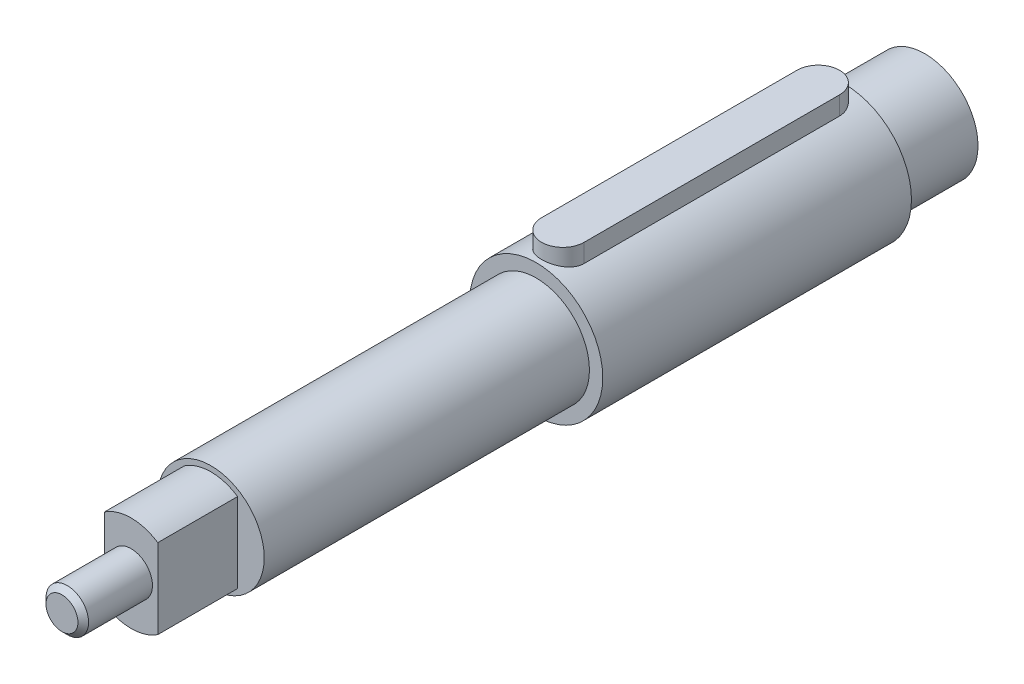
ISO-10303-21;
HEADER;
FILE_DESCRIPTION(('STEP AP214'),'2;1');
FILE_NAME('part.step','',(''),(''),'','','');
FILE_SCHEMA(('AUTOMOTIVE_DESIGN { 1 0 10303 214 1 1 1 1 }'));
ENDSEC;
DATA;
#1=APPLICATION_CONTEXT('core data for automotive mechanical design processes');
#2=APPLICATION_PROTOCOL_DEFINITION('international standard','automotive_design',2000,#1);
#3=PRODUCT_CONTEXT('',#1,'mechanical');
#4=PRODUCT('Part','Part','',(#3));
#5=PRODUCT_RELATED_PRODUCT_CATEGORY('part','',(#4));
#6=PRODUCT_DEFINITION_FORMATION('','',#4);
#7=PRODUCT_DEFINITION_CONTEXT('part definition',#1,'design');
#8=PRODUCT_DEFINITION('design','',#6,#7);
#9=PRODUCT_DEFINITION_SHAPE('','',#8);
#10=(LENGTH_UNIT() NAMED_UNIT(*) SI_UNIT(.MILLI.,.METRE.));
#11=(NAMED_UNIT(*) PLANE_ANGLE_UNIT() SI_UNIT($,.RADIAN.));
#12=(NAMED_UNIT(*) SI_UNIT($,.STERADIAN.) SOLID_ANGLE_UNIT());
#13=UNCERTAINTY_MEASURE_WITH_UNIT(LENGTH_MEASURE(1.E-05),#10,'distance_accuracy_value','');
#14=(GEOMETRIC_REPRESENTATION_CONTEXT(3) GLOBAL_UNCERTAINTY_ASSIGNED_CONTEXT((#13)) GLOBAL_UNIT_ASSIGNED_CONTEXT((#10,
#11,#12)) REPRESENTATION_CONTEXT('',''));
#15=CARTESIAN_POINT('',(0.,0.,0.));
#16=DIRECTION('',(0.,0.,1.));
#17=DIRECTION('',(1.,0.,0.));
#18=AXIS2_PLACEMENT_3D('',#15,#16,#17);
#19=CARTESIAN_POINT('',(0.,15.3,5.));
#20=DIRECTION('',(0.,-1.,0.));
#21=DIRECTION('',(0.,0.,-1.));
#22=AXIS2_PLACEMENT_3D('',#19,#20,#21);
#23=CYLINDRICAL_SURFACE('',#22,4.);
#24=CARTESIAN_POINT('',(0.,9.3,5.));
#25=DIRECTION('',(0.,1.,0.));
#26=DIRECTION('',(0.,0.,1.));
#27=AXIS2_PLACEMENT_3D('',#24,#25,#26);
#28=CIRCLE('',#27,4.);
#29=CARTESIAN_POINT('',(4.,9.3,5.));
#30=VERTEX_POINT('',#29);
#31=CARTESIAN_POINT('',(-4.,9.3,5.));
#32=VERTEX_POINT('',#31);
#33=EDGE_CURVE('E105',#30,#32,#28,.T.);
#34=ORIENTED_EDGE('',*,*,#33,.T.);
#35=DIRECTION('',(0.,-1.,0.));
#36=VECTOR('',#35,1.);
#37=CARTESIAN_POINT('',(-4.,15.3,5.));
#38=LINE('',#37,#36);
#39=CARTESIAN_POINT('',(-4.,15.3,5.));
#40=VERTEX_POINT('',#39);
#41=EDGE_CURVE('E12',#40,#32,#38,.T.);
#42=ORIENTED_EDGE('',*,*,#41,.F.);
#43=CARTESIAN_POINT('',(0.,15.3,5.));
#44=DIRECTION('',(0.,1.,0.));
#45=DIRECTION('',(0.,0.,1.));
#46=AXIS2_PLACEMENT_3D('',#43,#44,#45);
#47=CIRCLE('',#46,4.);
#48=CARTESIAN_POINT('',(4.,15.3,5.));
#49=VERTEX_POINT('',#48);
#50=EDGE_CURVE('E93',#49,#40,#47,.T.);
#51=ORIENTED_EDGE('',*,*,#50,.F.);
#52=DIRECTION('',(0.,-1.,0.));
#53=VECTOR('',#52,1.);
#54=CARTESIAN_POINT('',(4.,15.3,5.));
#55=LINE('',#54,#53);
#56=EDGE_CURVE('E101',#49,#30,#55,.T.);
#57=ORIENTED_EDGE('',*,*,#56,.T.);
#58=EDGE_LOOP('',(#34,#42,#51,#57));
#59=FACE_BOUND('',#58,.T.);
#60=ADVANCED_FACE('F42',(#59),#23,.T.);
#61=CARTESIAN_POINT('',(-4.,15.3,5.));
#62=DIRECTION('',(1.,0.,0.));
#63=DIRECTION('',(0.,0.,-1.));
#64=AXIS2_PLACEMENT_3D('',#61,#62,#63);
#65=PLANE('',#64);
#66=DIRECTION('',(0.,0.,1.));
#67=VECTOR('',#66,1.);
#68=CARTESIAN_POINT('',(-4.,9.3,5.));
#69=LINE('',#68,#67);
#70=CARTESIAN_POINT('',(-3.99999999999999,9.3,53.));
#71=VERTEX_POINT('',#70);
#72=EDGE_CURVE('E97',#32,#71,#69,.T.);
#73=ORIENTED_EDGE('',*,*,#72,.T.);
#74=DIRECTION('',(0.,-1.,0.));
#75=VECTOR('',#74,1.);
#76=CARTESIAN_POINT('',(-3.99999999999999,15.3,53.));
#77=LINE('',#76,#75);
#78=CARTESIAN_POINT('',(-3.99999999999999,15.3,53.));
#79=VERTEX_POINT('',#78);
#80=EDGE_CURVE('E50',#79,#71,#77,.T.);
#81=ORIENTED_EDGE('',*,*,#80,.F.);
#82=DIRECTION('',(0.,0.,1.));
#83=VECTOR('',#82,1.);
#84=CARTESIAN_POINT('',(-4.,15.3,5.));
#85=LINE('',#84,#83);
#86=EDGE_CURVE('E88',#40,#79,#85,.T.);
#87=ORIENTED_EDGE('',*,*,#86,.F.);
#88=ORIENTED_EDGE('',*,*,#41,.T.);
#89=EDGE_LOOP('',(#73,#81,#87,#88));
#90=FACE_BOUND('',#89,.T.);
#91=ADVANCED_FACE('F96',(#90),#65,.F.);
#92=CARTESIAN_POINT('',(0.,15.3,53.));
#93=DIRECTION('',(0.,-1.,0.));
#94=DIRECTION('',(0.,0.,-1.));
#95=AXIS2_PLACEMENT_3D('',#92,#93,#94);
#96=CYLINDRICAL_SURFACE('',#95,4.);
#97=CARTESIAN_POINT('',(0.,9.3,53.));
#98=DIRECTION('',(0.,1.,0.));
#99=DIRECTION('',(0.,0.,1.));
#100=AXIS2_PLACEMENT_3D('',#97,#98,#99);
#101=CIRCLE('',#100,4.);
#102=CARTESIAN_POINT('',(4.00000000000001,9.3,53.));
#103=VERTEX_POINT('',#102);
#104=EDGE_CURVE('E75',#71,#103,#101,.T.);
#105=ORIENTED_EDGE('',*,*,#104,.T.);
#106=DIRECTION('',(0.,-1.,0.));
#107=VECTOR('',#106,1.);
#108=CARTESIAN_POINT('',(4.00000000000001,15.3,53.));
#109=LINE('',#108,#107);
#110=CARTESIAN_POINT('',(4.00000000000001,15.3,53.));
#111=VERTEX_POINT('',#110);
#112=EDGE_CURVE('E98',#111,#103,#109,.T.);
#113=ORIENTED_EDGE('',*,*,#112,.F.);
#114=CARTESIAN_POINT('',(0.,15.3,53.));
#115=DIRECTION('',(0.,1.,0.));
#116=DIRECTION('',(0.,0.,1.));
#117=AXIS2_PLACEMENT_3D('',#114,#115,#116);
#118=CIRCLE('',#117,4.);
#119=EDGE_CURVE('E91',#79,#111,#118,.T.);
#120=ORIENTED_EDGE('',*,*,#119,.F.);
#121=ORIENTED_EDGE('',*,*,#80,.T.);
#122=EDGE_LOOP('',(#105,#113,#120,#121));
#123=FACE_BOUND('',#122,.T.);
#124=ADVANCED_FACE('F99',(#123),#96,.T.);
#125=CARTESIAN_POINT('',(4.00000000000001,15.3,53.));
#126=DIRECTION('',(-1.,0.,0.));
#127=DIRECTION('',(0.,0.,1.));
#128=AXIS2_PLACEMENT_3D('',#125,#126,#127);
#129=PLANE('',#128);
#130=DIRECTION('',(0.,0.,-1.));
#131=VECTOR('',#130,1.);
#132=CARTESIAN_POINT('',(4.00000000000001,9.3,53.));
#133=LINE('',#132,#131);
#134=EDGE_CURVE('E81',#103,#30,#133,.T.);
#135=ORIENTED_EDGE('',*,*,#134,.T.);
#136=ORIENTED_EDGE('',*,*,#56,.F.);
#137=DIRECTION('',(0.,0.,-1.));
#138=VECTOR('',#137,1.);
#139=CARTESIAN_POINT('',(4.00000000000001,15.3,53.));
#140=LINE('',#139,#138);
#141=EDGE_CURVE('E58',#111,#49,#140,.T.);
#142=ORIENTED_EDGE('',*,*,#141,.F.);
#143=ORIENTED_EDGE('',*,*,#112,.T.);
#144=EDGE_LOOP('',(#135,#136,#142,#143));
#145=FACE_BOUND('',#144,.T.);
#146=ADVANCED_FACE('F112',(#145),#129,.F.);
#147=CARTESIAN_POINT('',(0.,15.3,5.));
#148=DIRECTION('',(0.,1.,0.));
#149=DIRECTION('',(0.,0.,1.));
#150=AXIS2_PLACEMENT_3D('',#147,#148,#149);
#151=PLANE('',#150);
#152=ORIENTED_EDGE('',*,*,#50,.T.);
#153=ORIENTED_EDGE('',*,*,#86,.T.);
#154=ORIENTED_EDGE('',*,*,#119,.T.);
#155=ORIENTED_EDGE('',*,*,#141,.T.);
#156=EDGE_LOOP('',(#152,#153,#154,#155));
#157=FACE_BOUND('',#156,.T.);
#158=ADVANCED_FACE('F89',(#157),#151,.T.);
#159=CARTESIAN_POINT('',(0.,9.3,5.));
#160=DIRECTION('',(0.,1.,0.));
#161=DIRECTION('',(0.,0.,1.));
#162=AXIS2_PLACEMENT_3D('',#159,#160,#161);
#163=PLANE('',#162);
#164=ORIENTED_EDGE('',*,*,#33,.F.);
#165=ORIENTED_EDGE('',*,*,#134,.F.);
#166=ORIENTED_EDGE('',*,*,#104,.F.);
#167=ORIENTED_EDGE('',*,*,#72,.F.);
#168=EDGE_LOOP('',(#164,#165,#166,#167));
#169=FACE_BOUND('',#168,.T.);
#170=ADVANCED_FACE('F115',(#169),#163,.F.);
#171=CLOSED_SHELL('',(#60,#91,#124,#146,#158,#170));
#172=MANIFOLD_SOLID_BREP('B2',#171);
#173=CARTESIAN_POINT('',(0.,0.,134.1));
#174=DIRECTION('',(0.,0.,1.));
#175=DIRECTION('',(1.,0.,0.));
#176=AXIS2_PLACEMENT_3D('',#173,#174,#175);
#177=PLANE('',#176);
#178=CARTESIAN_POINT('',(0.,0.,134.1));
#179=DIRECTION('',(0.,0.,1.));
#180=DIRECTION('',(1.,0.,0.));
#181=AXIS2_PLACEMENT_3D('',#178,#179,#180);
#182=CIRCLE('',#181,9.);
#183=CARTESIAN_POINT('',(5.,7.48331477354788,134.1));
#184=VERTEX_POINT('',#183);
#185=CARTESIAN_POINT('',(-5.,7.48331477354788,134.1));
#186=VERTEX_POINT('',#185);
#187=EDGE_CURVE('E241',#184,#186,#182,.T.);
#188=ORIENTED_EDGE('',*,*,#187,.T.);
#189=DIRECTION('',(0.,-1.,0.));
#190=VECTOR('',#189,1.);
#191=CARTESIAN_POINT('',(-5.,7.48331477354788,134.1));
#192=LINE('',#191,#190);
#193=CARTESIAN_POINT('',(-5.,-7.48331477354788,134.1));
#194=VERTEX_POINT('',#193);
#195=EDGE_CURVE('E230',#186,#194,#192,.T.);
#196=ORIENTED_EDGE('',*,*,#195,.T.);
#197=CARTESIAN_POINT('',(0.,0.,134.1));
#198=DIRECTION('',(0.,0.,1.));
#199=DIRECTION('',(1.,0.,0.));
#200=AXIS2_PLACEMENT_3D('',#197,#198,#199);
#201=CIRCLE('',#200,9.);
#202=CARTESIAN_POINT('',(5.,-7.48331477354788,134.1));
#203=VERTEX_POINT('',#202);
#204=EDGE_CURVE('E240',#194,#203,#201,.T.);
#205=ORIENTED_EDGE('',*,*,#204,.T.);
#206=DIRECTION('',(0.,1.,0.));
#207=VECTOR('',#206,1.);
#208=CARTESIAN_POINT('',(5.,7.48331477354788,134.1));
#209=LINE('',#208,#207);
#210=EDGE_CURVE('E245',#203,#184,#209,.T.);
#211=ORIENTED_EDGE('',*,*,#210,.T.);
#212=EDGE_LOOP('',(#188,#196,#205,#211));
#213=FACE_BOUND('',#212,.T.);
#214=CARTESIAN_POINT('',(0.,0.,134.1));
#215=DIRECTION('',(0.,0.,1.));
#216=DIRECTION('',(1.,0.,0.));
#217=AXIS2_PLACEMENT_3D('',#214,#215,#216);
#218=CIRCLE('',#217,4.);
#219=CARTESIAN_POINT('',(4.,0.,134.1));
#220=VERTEX_POINT('',#219);
#221=EDGE_CURVE('E498',#220,#220,#218,.T.);
#222=ORIENTED_EDGE('',*,*,#221,.F.);
#223=EDGE_LOOP('',(#222));
#224=FACE_BOUND('',#223,.T.);
#225=ADVANCED_FACE('F165',(#213,#224),#177,.T.);
#226=CARTESIAN_POINT('',(0.,0.,119.1));
#227=DIRECTION('',(0.,0.,1.));
#228=DIRECTION('',(1.,0.,0.));
#229=AXIS2_PLACEMENT_3D('',#226,#227,#228);
#230=PLANE('',#229);
#231=CARTESIAN_POINT('',(0.,0.,119.1));
#232=DIRECTION('',(0.,0.,1.));
#233=DIRECTION('',(1.,0.,0.));
#234=AXIS2_PLACEMENT_3D('',#231,#232,#233);
#235=CIRCLE('',#234,10.);
#236=CARTESIAN_POINT('',(10.,0.,119.1));
#237=VERTEX_POINT('',#236);
#238=EDGE_CURVE('E258',#237,#237,#235,.T.);
#239=ORIENTED_EDGE('',*,*,#238,.T.);
#240=EDGE_LOOP('',(#239));
#241=FACE_BOUND('',#240,.T.);
#242=DIRECTION('',(0.,-1.,0.));
#243=VECTOR('',#242,1.);
#244=CARTESIAN_POINT('',(-5.,7.48331477354788,119.1));
#245=LINE('',#244,#243);
#246=CARTESIAN_POINT('',(-5.,7.48331477354788,119.1));
#247=VERTEX_POINT('',#246);
#248=CARTESIAN_POINT('',(-5.,-7.48331477354788,119.1));
#249=VERTEX_POINT('',#248);
#250=EDGE_CURVE('E500',#247,#249,#245,.T.);
#251=ORIENTED_EDGE('',*,*,#250,.F.);
#252=CARTESIAN_POINT('',(0.,0.,119.1));
#253=DIRECTION('',(0.,0.,1.));
#254=DIRECTION('',(1.,0.,0.));
#255=AXIS2_PLACEMENT_3D('',#252,#253,#254);
#256=CIRCLE('',#255,9.);
#257=CARTESIAN_POINT('',(5.,7.48331477354788,119.1));
#258=VERTEX_POINT('',#257);
#259=EDGE_CURVE('E253',#258,#247,#256,.T.);
#260=ORIENTED_EDGE('',*,*,#259,.F.);
#261=DIRECTION('',(0.,1.,0.));
#262=VECTOR('',#261,1.);
#263=CARTESIAN_POINT('',(5.,7.48331477354788,119.1));
#264=LINE('',#263,#262);
#265=CARTESIAN_POINT('',(5.,-7.48331477354788,119.1));
#266=VERTEX_POINT('',#265);
#267=EDGE_CURVE('E249',#266,#258,#264,.T.);
#268=ORIENTED_EDGE('',*,*,#267,.F.);
#269=CARTESIAN_POINT('',(0.,0.,119.1));
#270=DIRECTION('',(0.,0.,1.));
#271=DIRECTION('',(1.,0.,0.));
#272=AXIS2_PLACEMENT_3D('',#269,#270,#271);
#273=CIRCLE('',#272,9.);
#274=EDGE_CURVE('E507',#249,#266,#273,.T.);
#275=ORIENTED_EDGE('',*,*,#274,.F.);
#276=EDGE_LOOP('',(#251,#260,#268,#275));
#277=FACE_BOUND('',#276,.T.);
#278=ADVANCED_FACE('F347',(#241,#277),#230,.T.);
#279=CARTESIAN_POINT('',(0.,0.,58.));
#280=DIRECTION('',(0.,0.,1.));
#281=DIRECTION('',(1.,0.,0.));
#282=AXIS2_PLACEMENT_3D('',#279,#280,#281);
#283=PLANE('',#282);
#284=CARTESIAN_POINT('',(0.,0.,58.));
#285=DIRECTION('',(0.,0.,1.));
#286=DIRECTION('',(1.,0.,0.));
#287=AXIS2_PLACEMENT_3D('',#284,#285,#286);
#288=CIRCLE('',#287,12.5);
#289=CARTESIAN_POINT('',(12.5,0.,58.));
#290=VERTEX_POINT('',#289);
#291=EDGE_CURVE('E288',#290,#290,#288,.T.);
#292=ORIENTED_EDGE('',*,*,#291,.T.);
#293=EDGE_LOOP('',(#292));
#294=FACE_BOUND('',#293,.T.);
#295=CARTESIAN_POINT('',(0.,0.,58.));
#296=DIRECTION('',(0.,0.,1.));
#297=DIRECTION('',(1.,0.,0.));
#298=AXIS2_PLACEMENT_3D('',#295,#296,#297);
#299=CIRCLE('',#298,10.);
#300=CARTESIAN_POINT('',(10.,0.,58.));
#301=VERTEX_POINT('',#300);
#302=EDGE_CURVE('E255',#301,#301,#299,.T.);
#303=ORIENTED_EDGE('',*,*,#302,.F.);
#304=EDGE_LOOP('',(#303));
#305=FACE_BOUND('',#304,.T.);
#306=ADVANCED_FACE('F324',(#294,#305),#283,.T.);
#307=CARTESIAN_POINT('',(0.,0.,0.));
#308=DIRECTION('',(0.,0.,1.));
#309=DIRECTION('',(1.,0.,0.));
#310=AXIS2_PLACEMENT_3D('',#307,#308,#309);
#311=PLANE('',#310);
#312=CARTESIAN_POINT('',(0.,0.,0.));
#313=DIRECTION('',(0.,0.,1.));
#314=DIRECTION('',(1.,0.,0.));
#315=AXIS2_PLACEMENT_3D('',#312,#313,#314);
#316=CIRCLE('',#315,12.5);
#317=CARTESIAN_POINT('',(12.5,0.,0.));
#318=VERTEX_POINT('',#317);
#319=EDGE_CURVE('E287',#318,#318,#316,.T.);
#320=ORIENTED_EDGE('',*,*,#319,.F.);
#321=EDGE_LOOP('',(#320));
#322=FACE_BOUND('',#321,.T.);
#323=CARTESIAN_POINT('',(0.,0.,0.));
#324=DIRECTION('',(0.,0.,1.));
#325=DIRECTION('',(1.,0.,0.));
#326=AXIS2_PLACEMENT_3D('',#323,#324,#325);
#327=CIRCLE('',#326,10.);
#328=CARTESIAN_POINT('',(10.,0.,0.));
#329=VERTEX_POINT('',#328);
#330=EDGE_CURVE('E331',#329,#329,#327,.F.);
#331=ORIENTED_EDGE('',*,*,#330,.F.);
#332=EDGE_LOOP('',(#331));
#333=FACE_BOUND('',#332,.T.);
#334=ADVANCED_FACE('F396',(#322,#333),#311,.F.);
#335=CARTESIAN_POINT('',(0.,0.,58.));
#336=DIRECTION('',(0.,0.,-1.));
#337=DIRECTION('',(-1.,0.,0.));
#338=AXIS2_PLACEMENT_3D('',#335,#336,#337);
#339=CYLINDRICAL_SURFACE('',#338,12.5);
#340=ORIENTED_EDGE('',*,*,#319,.T.);
#341=EDGE_LOOP('',(#340));
#342=FACE_BOUND('',#341,.T.);
#343=ORIENTED_EDGE('',*,*,#291,.F.);
#344=EDGE_LOOP('',(#343));
#345=FACE_BOUND('',#344,.T.);
#346=CARTESIAN_POINT('',(4.,11.842719282327,5.));
#347=CARTESIAN_POINT('',(4.00001410484613,11.8427027366058,4.8906002280384));
#348=CARTESIAN_POINT('',(3.995512175201,11.8442348052368,4.7812097901521));
#349=CARTESIAN_POINT('',(3.97758606678449,11.8502730910574,4.56327175926352));
#350=CARTESIAN_POINT('',(3.96416412872571,11.8547785613244,4.45472396151551));
#351=CARTESIAN_POINT('',(3.9285572511943,11.8666242076309,4.23953896915451));
#352=CARTESIAN_POINT('',(3.9063967602145,11.8739564736691,4.13289730438877));
#353=CARTESIAN_POINT('',(3.85353581488657,11.8912164993788,3.92199436162844));
#354=CARTESIAN_POINT('',(3.82283508754056,11.90114434202,3.81773315984322));
#355=CARTESIAN_POINT('',(3.71831764495512,11.9343840843196,3.50969499572164));
#356=CARTESIAN_POINT('',(3.63203544139888,11.9611699822066,3.31036344793197));
#357=CARTESIAN_POINT('',(3.42895021192288,12.0209583955878,2.92898744295816));
#358=CARTESIAN_POINT('',(3.31213030924909,12.0539643457894,2.74695262095034));
#359=CARTESIAN_POINT('',(3.0467850788479,12.123798407807,2.39874601140078));
#360=CARTESIAN_POINT('',(2.89735303896514,12.1607158548651,2.23328167566054));
#361=CARTESIAN_POINT('',(2.57296449846116,12.2334561140966,1.92928515141109));
#362=CARTESIAN_POINT('',(2.39800356343233,12.2692787347869,1.79075765164231));
#363=CARTESIAN_POINT('',(2.02237003010512,12.3368244653945,1.54138480162945));
#364=CARTESIAN_POINT('',(1.82118394546976,12.3684294972003,1.43127804353036));
#365=CARTESIAN_POINT('',(1.40197197350369,12.4229251649937,1.24675050465062));
#366=CARTESIAN_POINT('',(1.18395091903581,12.4458182908278,1.1723195262181));
#367=CARTESIAN_POINT('',(0.744713961063365,12.4796767811416,1.0636411357495));
#368=CARTESIAN_POINT('',(0.523827920101156,12.4910030499338,1.02817506661988));
#369=CARTESIAN_POINT('',(0.0789648151746391,12.5017287122873,0.994567200958359));
#370=CARTESIAN_POINT('',(-0.14501156419764,12.5011307063103,0.996417266475156));
#371=CARTESIAN_POINT('',(-0.581094974437689,12.4883236673358,1.03659882927133));
#372=CARTESIAN_POINT('',(-0.793338226675236,12.4765355800409,1.07360776797881));
#373=CARTESIAN_POINT('',(-1.2084232001272,12.443194578958,1.18088055160631));
#374=CARTESIAN_POINT('',(-1.41126440871778,12.4216411334261,1.2511462074328));
#375=CARTESIAN_POINT('',(-1.80478548808183,12.3706364987475,1.42375784223576));
#376=CARTESIAN_POINT('',(-1.99528012693526,12.3410893067347,1.52649651986879));
#377=CARTESIAN_POINT('',(-2.35673113106228,12.2771965403044,1.76082904904521));
#378=CARTESIAN_POINT('',(-2.5276825327575,12.2428497517893,1.89243020640298));
#379=CARTESIAN_POINT('',(-2.8530451152822,12.1712409097156,2.18744653129156));
#380=CARTESIAN_POINT('',(-3.00641313381737,12.1339170352569,2.3519967025921));
#381=CARTESIAN_POINT('',(-3.28377291775701,12.0618172896256,2.7049719000853));
#382=CARTESIAN_POINT('',(-3.40775562728565,12.0270422062066,2.89340425883215));
#383=CARTESIAN_POINT('',(-3.56958208232607,11.9796198433082,3.19137123774859));
#384=CARTESIAN_POINT('',(-3.61975674493765,11.9645161845072,3.29399905924154));
#385=CARTESIAN_POINT('',(-3.71123075156255,11.9364591580623,3.50340475275169));
#386=CARTESIAN_POINT('',(-3.75253376401034,11.9235049021446,3.61018088778642));
#387=CARTESIAN_POINT('',(-3.82585831579178,11.9001802342949,3.82701332789163));
#388=CARTESIAN_POINT('',(-3.85788979915529,11.889807055759,3.93706597797312));
#389=CARTESIAN_POINT('',(-3.91241790563964,11.8719756673203,4.15969515694759));
#390=CARTESIAN_POINT('',(-3.93491889994975,11.8645161211931,4.27227050379743));
#391=CARTESIAN_POINT('',(-3.96832908530803,11.8533815888388,4.48723924586098));
#392=CARTESIAN_POINT('',(-3.9802038456482,11.8493925948395,4.5894674157946));
#393=CARTESIAN_POINT('',(-3.99603937127681,11.8440568016292,4.79446107803332));
#394=CARTESIAN_POINT('',(-4.00001099551563,11.8427063770563,4.89722563828054));
#395=CARTESIAN_POINT('',(-4.,11.842719282327,5.));
#396=B_SPLINE_CURVE_WITH_KNOTS('',3,(#346,#347,#348,#349,#350,#351,#352,#353,#354,#355,#356,
#357,#358,#359,#360,#361,#362,#363,#364,#365,#366,#367,#368,#369,#370,#371,#372,#373,#374,#375,
#376,#377,#378,#379,#380,#381,#382,#383,#384,#385,#386,#387,#388,#389,#390,#391,#392,#393,#394,
#395),.UNSPECIFIED.,.F.,.F.,(4,2,2,2,2,2,2,2,2,2,2,2,2,2,2,2,2,2,2,2,2,2,2,2,4),(0.,
0.328080176984103,0.656077971124947,0.983164539368217,1.310261564488,1.96355293984248,
2.61720612481382,3.29209427898755,3.96709980211697,4.65819584662373,5.34909422856993,
6.01770820975085,6.68617638029993,7.3304550155383,7.97476873730064,8.6271932010581,
9.27978300073407,9.96076419384897,10.6419549776068,10.9872862883783,11.3324745283028,
11.6772911585126,12.0219494657669,12.3305938648259,12.6388138912331),.UNSPECIFIED.);
#397=CARTESIAN_POINT('',(4.,11.842719282327,5.));
#398=VERTEX_POINT('',#397);
#399=CARTESIAN_POINT('',(-4.,11.842719282327,5.));
#400=VERTEX_POINT('',#399);
#401=EDGE_CURVE('E325',#398,#400,#396,.T.);
#402=ORIENTED_EDGE('',*,*,#401,.F.);
#403=DIRECTION('',(0.,0.,-1.));
#404=VECTOR('',#403,1.);
#405=CARTESIAN_POINT('',(4.00000000000001,11.842719282327,58.));
#406=LINE('',#405,#404);
#407=CARTESIAN_POINT('',(4.00000000000001,11.842719282327,53.));
#408=VERTEX_POINT('',#407);
#409=EDGE_CURVE('E291',#408,#398,#406,.T.);
#410=ORIENTED_EDGE('',*,*,#409,.F.);
#411=CARTESIAN_POINT('',(-3.99999999999999,11.842719282327,53.));
#412=CARTESIAN_POINT('',(-4.00001410484612,11.8427027366058,53.1093997719616));
#413=CARTESIAN_POINT('',(-3.99551217520099,11.8442348052368,53.2187902098479));
#414=CARTESIAN_POINT('',(-3.97758606678449,11.8502730910574,53.4367282407365));
#415=CARTESIAN_POINT('',(-3.9641641287257,11.8547785613244,53.5452760384845));
#416=CARTESIAN_POINT('',(-3.92855725119429,11.8666242076309,53.7604610308455));
#417=CARTESIAN_POINT('',(-3.90639676021449,11.8739564736692,53.8671026956112));
#418=CARTESIAN_POINT('',(-3.85353581488656,11.8912164993788,54.0780056383716));
#419=CARTESIAN_POINT('',(-3.82283508754055,11.90114434202,54.1822668401568));
#420=CARTESIAN_POINT('',(-3.71831764495512,11.9343840843196,54.4903050042784));
#421=CARTESIAN_POINT('',(-3.63203544139887,11.9611699822066,54.689636552068));
#422=CARTESIAN_POINT('',(-3.42895021192288,12.0209583955878,55.0710125570418));
#423=CARTESIAN_POINT('',(-3.31213030924909,12.0539643457894,55.2530473790497));
#424=CARTESIAN_POINT('',(-3.0467850788479,12.123798407807,55.6012539885992));
#425=CARTESIAN_POINT('',(-2.89735303896514,12.1607158548651,55.7667183243395));
#426=CARTESIAN_POINT('',(-2.57296449846116,12.2334561140966,56.0707148485889));
#427=CARTESIAN_POINT('',(-2.39800356343232,12.2692787347869,56.2092423483577));
#428=CARTESIAN_POINT('',(-2.02237003010512,12.3368244653945,56.4586151983705));
#429=CARTESIAN_POINT('',(-1.82118394546976,12.3684294972003,56.5687219564696));
#430=CARTESIAN_POINT('',(-1.40197197350369,12.4229251649937,56.7532494953494));
#431=CARTESIAN_POINT('',(-1.18395091903581,12.4458182908278,56.8276804737819));
#432=CARTESIAN_POINT('',(-0.744713961063366,12.4796767811416,56.9363588642505));
#433=CARTESIAN_POINT('',(-0.523827920101156,12.4910030499338,56.9718249333801));
#434=CARTESIAN_POINT('',(-0.0789648151746387,12.5017287122873,57.0054327990416));
#435=CARTESIAN_POINT('',(0.14501156419764,12.5011307063103,57.0035827335248));
#436=CARTESIAN_POINT('',(0.58109497443769,12.4883236673358,56.9634011707287));
#437=CARTESIAN_POINT('',(0.793338226675236,12.4765355800409,56.9263922320212));
#438=CARTESIAN_POINT('',(1.2084232001272,12.443194578958,56.8191194483937));
#439=CARTESIAN_POINT('',(1.41126440871778,12.4216411334261,56.7488537925672));
#440=CARTESIAN_POINT('',(1.80478548808183,12.3706364987475,56.5762421577642));
#441=CARTESIAN_POINT('',(1.99528012693527,12.3410893067347,56.4735034801312));
#442=CARTESIAN_POINT('',(2.35673113106229,12.2771965403044,56.2391709509548));
#443=CARTESIAN_POINT('',(2.5276825327575,12.2428497517893,56.107569793597));
#444=CARTESIAN_POINT('',(2.85304511528221,12.1712409097156,55.8125534687085));
#445=CARTESIAN_POINT('',(3.00641313381737,12.1339170352569,55.6480032974079));
#446=CARTESIAN_POINT('',(3.28377291775701,12.0618172896256,55.2950280999147));
#447=CARTESIAN_POINT('',(3.40775562728565,12.0270422062066,55.1065957411679));
#448=CARTESIAN_POINT('',(3.56958208232607,11.9796198433082,54.8086287622514));
#449=CARTESIAN_POINT('',(3.61975674493765,11.9645161845072,54.7060009407585));
#450=CARTESIAN_POINT('',(3.71123075156255,11.9364591580623,54.4965952472483));
#451=CARTESIAN_POINT('',(3.75253376401034,11.9235049021446,54.3898191122136));
#452=CARTESIAN_POINT('',(3.82585831579179,11.9001802342949,54.1729866721084));
#453=CARTESIAN_POINT('',(3.85788979915529,11.889807055759,54.0629340220269));
#454=CARTESIAN_POINT('',(3.91241790563964,11.8719756673203,53.8403048430524));
#455=CARTESIAN_POINT('',(3.93491889994976,11.8645161211931,53.7277294962026));
#456=CARTESIAN_POINT('',(3.96832908530804,11.8533815888388,53.512760754139));
#457=CARTESIAN_POINT('',(3.9802038456482,11.8493925948395,53.4105325842054));
#458=CARTESIAN_POINT('',(3.99603937127681,11.8440568016292,53.2055389219667));
#459=CARTESIAN_POINT('',(4.00001099551564,11.8427063770563,53.1027743617195));
#460=CARTESIAN_POINT('',(4.00000000000001,11.842719282327,53.));
#461=B_SPLINE_CURVE_WITH_KNOTS('',3,(#411,#412,#413,#414,#415,#416,#417,#418,#419,#420,#421,
#422,#423,#424,#425,#426,#427,#428,#429,#430,#431,#432,#433,#434,#435,#436,#437,#438,#439,#440,
#441,#442,#443,#444,#445,#446,#447,#448,#449,#450,#451,#452,#453,#454,#455,#456,#457,#458,#459,
#460),.UNSPECIFIED.,.F.,.F.,(4,2,2,2,2,2,2,2,2,2,2,2,2,2,2,2,2,2,2,2,2,2,2,2,4),(0.,
0.328080176984104,0.65607797112495,0.983164539368213,1.31026156448799,1.96355293984248,
2.61720612481382,3.29209427898756,3.96709980211696,4.65819584662372,5.34909422856992,
6.01770820975085,6.68617638029993,7.33045501553829,7.97476873730064,8.62719320105809,
9.27978300073406,9.96076419384897,10.6419549776068,10.9872862883783,11.3324745283028,
11.6772911585126,12.0219494657669,12.3305938648259,12.6388138912331),.UNSPECIFIED.);
#462=CARTESIAN_POINT('',(-3.99999999999999,11.842719282327,53.));
#463=VERTEX_POINT('',#462);
#464=EDGE_CURVE('E295',#463,#408,#461,.T.);
#465=ORIENTED_EDGE('',*,*,#464,.F.);
#466=DIRECTION('',(0.,0.,-1.));
#467=VECTOR('',#466,1.);
#468=CARTESIAN_POINT('',(-3.99999999999999,11.842719282327,58.));
#469=LINE('',#468,#467);
#470=EDGE_CURVE('E302',#400,#463,#469,.F.);
#471=ORIENTED_EDGE('',*,*,#470,.F.);
#472=EDGE_LOOP('',(#402,#410,#465,#471));
#473=FACE_BOUND('',#472,.T.);
#474=ADVANCED_FACE('F304',(#342,#345,#473),#339,.T.);
#475=CARTESIAN_POINT('',(0.,69.3,5.));
#476=DIRECTION('',(0.,-1.,0.));
#477=DIRECTION('',(0.,0.,-1.));
#478=AXIS2_PLACEMENT_3D('',#475,#476,#477);
#479=CYLINDRICAL_SURFACE('',#478,4.);
#480=ORIENTED_EDGE('',*,*,#401,.T.);
#481=DIRECTION('',(0.,-1.,0.));
#482=VECTOR('',#481,1.);
#483=CARTESIAN_POINT('',(-4.,69.3,5.));
#484=LINE('',#483,#482);
#485=CARTESIAN_POINT('',(-4.,9.3,5.));
#486=VERTEX_POINT('',#485);
#487=EDGE_CURVE('E285',#400,#486,#484,.T.);
#488=ORIENTED_EDGE('',*,*,#487,.T.);
#489=CARTESIAN_POINT('',(0.,9.3,5.));
#490=DIRECTION('',(0.,1.,0.));
#491=DIRECTION('',(0.,0.,1.));
#492=AXIS2_PLACEMENT_3D('',#489,#490,#491);
#493=CIRCLE('',#492,4.);
#494=CARTESIAN_POINT('',(4.,9.3,5.));
#495=VERTEX_POINT('',#494);
#496=EDGE_CURVE('E268',#495,#486,#493,.T.);
#497=ORIENTED_EDGE('',*,*,#496,.F.);
#498=DIRECTION('',(0.,-1.,0.));
#499=VECTOR('',#498,1.);
#500=CARTESIAN_POINT('',(4.,69.3,5.));
#501=LINE('',#500,#499);
#502=EDGE_CURVE('E280',#398,#495,#501,.T.);
#503=ORIENTED_EDGE('',*,*,#502,.F.);
#504=EDGE_LOOP('',(#480,#488,#497,#503));
#505=FACE_BOUND('',#504,.T.);
#506=ADVANCED_FACE('F318',(#505),#479,.F.);
#507=CARTESIAN_POINT('',(-4.,69.3,5.));
#508=DIRECTION('',(1.,0.,0.));
#509=DIRECTION('',(0.,0.,-1.));
#510=AXIS2_PLACEMENT_3D('',#507,#508,#509);
#511=PLANE('',#510);
#512=ORIENTED_EDGE('',*,*,#470,.T.);
#513=DIRECTION('',(0.,-1.,0.));
#514=VECTOR('',#513,1.);
#515=CARTESIAN_POINT('',(-3.99999999999999,69.3,53.));
#516=LINE('',#515,#514);
#517=CARTESIAN_POINT('',(-3.99999999999999,9.3,53.));
#518=VERTEX_POINT('',#517);
#519=EDGE_CURVE('E283',#463,#518,#516,.T.);
#520=ORIENTED_EDGE('',*,*,#519,.T.);
#521=DIRECTION('',(0.,0.,1.));
#522=VECTOR('',#521,1.);
#523=CARTESIAN_POINT('',(-4.,9.3,5.));
#524=LINE('',#523,#522);
#525=EDGE_CURVE('E271',#486,#518,#524,.T.);
#526=ORIENTED_EDGE('',*,*,#525,.F.);
#527=ORIENTED_EDGE('',*,*,#487,.F.);
#528=EDGE_LOOP('',(#512,#520,#526,#527));
#529=FACE_BOUND('',#528,.T.);
#530=ADVANCED_FACE('F313',(#529),#511,.T.);
#531=CARTESIAN_POINT('',(0.,69.3,53.));
#532=DIRECTION('',(0.,-1.,0.));
#533=DIRECTION('',(0.,0.,-1.));
#534=AXIS2_PLACEMENT_3D('',#531,#532,#533);
#535=CYLINDRICAL_SURFACE('',#534,4.);
#536=ORIENTED_EDGE('',*,*,#464,.T.);
#537=DIRECTION('',(0.,-1.,0.));
#538=VECTOR('',#537,1.);
#539=CARTESIAN_POINT('',(4.00000000000001,69.3,53.));
#540=LINE('',#539,#538);
#541=CARTESIAN_POINT('',(4.00000000000001,9.3,53.));
#542=VERTEX_POINT('',#541);
#543=EDGE_CURVE('E188',#408,#542,#540,.T.);
#544=ORIENTED_EDGE('',*,*,#543,.T.);
#545=CARTESIAN_POINT('',(0.,9.3,53.));
#546=DIRECTION('',(0.,1.,0.));
#547=DIRECTION('',(0.,0.,1.));
#548=AXIS2_PLACEMENT_3D('',#545,#546,#547);
#549=CIRCLE('',#548,4.);
#550=EDGE_CURVE('E274',#518,#542,#549,.T.);
#551=ORIENTED_EDGE('',*,*,#550,.F.);
#552=ORIENTED_EDGE('',*,*,#519,.F.);
#553=EDGE_LOOP('',(#536,#544,#551,#552));
#554=FACE_BOUND('',#553,.T.);
#555=ADVANCED_FACE('F307',(#554),#535,.F.);
#556=CARTESIAN_POINT('',(4.,69.3,5.));
#557=DIRECTION('',(-1.,0.,0.));
#558=DIRECTION('',(0.,0.,1.));
#559=AXIS2_PLACEMENT_3D('',#556,#557,#558);
#560=PLANE('',#559);
#561=ORIENTED_EDGE('',*,*,#409,.T.);
#562=ORIENTED_EDGE('',*,*,#502,.T.);
#563=DIRECTION('',(0.,0.,-1.));
#564=VECTOR('',#563,1.);
#565=CARTESIAN_POINT('',(4.,9.3,5.));
#566=LINE('',#565,#564);
#567=EDGE_CURVE('E277',#542,#495,#566,.T.);
#568=ORIENTED_EDGE('',*,*,#567,.F.);
#569=ORIENTED_EDGE('',*,*,#543,.F.);
#570=EDGE_LOOP('',(#561,#562,#568,#569));
#571=FACE_BOUND('',#570,.T.);
#572=ADVANCED_FACE('F312',(#571),#560,.T.);
#573=CARTESIAN_POINT('',(0.,9.3,5.));
#574=DIRECTION('',(0.,1.,0.));
#575=DIRECTION('',(0.,0.,1.));
#576=AXIS2_PLACEMENT_3D('',#573,#574,#575);
#577=PLANE('',#576);
#578=ORIENTED_EDGE('',*,*,#496,.T.);
#579=ORIENTED_EDGE('',*,*,#525,.T.);
#580=ORIENTED_EDGE('',*,*,#550,.T.);
#581=ORIENTED_EDGE('',*,*,#567,.T.);
#582=EDGE_LOOP('',(#578,#579,#580,#581));
#583=FACE_BOUND('',#582,.T.);
#584=ADVANCED_FACE('F377',(#583),#577,.T.);
#585=CARTESIAN_POINT('',(0.,0.,-15.));
#586=DIRECTION('',(0.,0.,1.));
#587=DIRECTION('',(1.,0.,0.));
#588=AXIS2_PLACEMENT_3D('',#585,#586,#587);
#589=CYLINDRICAL_SURFACE('',#588,10.);
#590=CARTESIAN_POINT('',(0.,0.,-15.));
#591=DIRECTION('',(0.,0.,-1.));
#592=DIRECTION('',(-1.,0.,0.));
#593=AXIS2_PLACEMENT_3D('',#590,#591,#592);
#594=CIRCLE('',#593,10.);
#595=CARTESIAN_POINT('',(-10.,0.,-15.));
#596=VERTEX_POINT('',#595);
#597=EDGE_CURVE('E264',#596,#596,#594,.T.);
#598=ORIENTED_EDGE('',*,*,#597,.F.);
#599=EDGE_LOOP('',(#598));
#600=FACE_BOUND('',#599,.T.);
#601=ORIENTED_EDGE('',*,*,#330,.T.);
#602=EDGE_LOOP('',(#601));
#603=FACE_BOUND('',#602,.T.);
#604=ADVANCED_FACE('F374',(#600,#603),#589,.T.);
#605=CARTESIAN_POINT('',(0.,0.,-15.));
#606=DIRECTION('',(0.,0.,-1.));
#607=DIRECTION('',(-1.,0.,0.));
#608=AXIS2_PLACEMENT_3D('',#605,#606,#607);
#609=PLANE('',#608);
#610=ORIENTED_EDGE('',*,*,#597,.T.);
#611=EDGE_LOOP('',(#610));
#612=FACE_BOUND('',#611,.T.);
#613=ADVANCED_FACE('F370',(#612),#609,.T.);
#614=CARTESIAN_POINT('',(0.,0.,119.1));
#615=DIRECTION('',(0.,0.,-1.));
#616=DIRECTION('',(-1.,0.,0.));
#617=AXIS2_PLACEMENT_3D('',#614,#615,#616);
#618=CYLINDRICAL_SURFACE('',#617,10.);
#619=ORIENTED_EDGE('',*,*,#238,.F.);
#620=EDGE_LOOP('',(#619));
#621=FACE_BOUND('',#620,.T.);
#622=ORIENTED_EDGE('',*,*,#302,.T.);
#623=EDGE_LOOP('',(#622));
#624=FACE_BOUND('',#623,.T.);
#625=ADVANCED_FACE('F366',(#621,#624),#618,.T.);
#626=CARTESIAN_POINT('',(0.,0.,134.1));
#627=DIRECTION('',(0.,0.,-1.));
#628=DIRECTION('',(-1.,0.,0.));
#629=AXIS2_PLACEMENT_3D('',#626,#627,#628);
#630=CYLINDRICAL_SURFACE('',#629,9.);
#631=ORIENTED_EDGE('',*,*,#259,.T.);
#632=DIRECTION('',(0.,0.,-1.));
#633=VECTOR('',#632,1.);
#634=CARTESIAN_POINT('',(-5.,7.48331477354788,134.1));
#635=LINE('',#634,#633);
#636=EDGE_CURVE('E234',#186,#247,#635,.T.);
#637=ORIENTED_EDGE('',*,*,#636,.F.);
#638=ORIENTED_EDGE('',*,*,#187,.F.);
#639=DIRECTION('',(0.,0.,-1.));
#640=VECTOR('',#639,1.);
#641=CARTESIAN_POINT('',(5.,7.48331477354788,134.1));
#642=LINE('',#641,#640);
#643=EDGE_CURVE('E504',#184,#258,#642,.T.);
#644=ORIENTED_EDGE('',*,*,#643,.T.);
#645=EDGE_LOOP('',(#631,#637,#638,#644));
#646=FACE_BOUND('',#645,.T.);
#647=ADVANCED_FACE('F251',(#646),#630,.T.);
#648=CARTESIAN_POINT('',(-5.,7.48331477354788,134.1));
#649=DIRECTION('',(1.,0.,0.));
#650=DIRECTION('',(0.,1.,0.));
#651=AXIS2_PLACEMENT_3D('',#648,#649,#650);
#652=PLANE('',#651);
#653=ORIENTED_EDGE('',*,*,#250,.T.);
#654=DIRECTION('',(0.,0.,-1.));
#655=VECTOR('',#654,1.);
#656=CARTESIAN_POINT('',(-5.,-7.48331477354788,134.1));
#657=LINE('',#656,#655);
#658=EDGE_CURVE('E237',#194,#249,#657,.T.);
#659=ORIENTED_EDGE('',*,*,#658,.F.);
#660=ORIENTED_EDGE('',*,*,#195,.F.);
#661=ORIENTED_EDGE('',*,*,#636,.T.);
#662=EDGE_LOOP('',(#653,#659,#660,#661));
#663=FACE_BOUND('',#662,.T.);
#664=ADVANCED_FACE('F232',(#663),#652,.F.);
#665=CARTESIAN_POINT('',(0.,0.,134.1));
#666=DIRECTION('',(0.,0.,-1.));
#667=DIRECTION('',(-1.,0.,0.));
#668=AXIS2_PLACEMENT_3D('',#665,#666,#667);
#669=CYLINDRICAL_SURFACE('',#668,9.);
#670=ORIENTED_EDGE('',*,*,#274,.T.);
#671=DIRECTION('',(0.,0.,-1.));
#672=VECTOR('',#671,1.);
#673=CARTESIAN_POINT('',(5.,-7.48331477354788,134.1));
#674=LINE('',#673,#672);
#675=EDGE_CURVE('E180',#203,#266,#674,.T.);
#676=ORIENTED_EDGE('',*,*,#675,.F.);
#677=ORIENTED_EDGE('',*,*,#204,.F.);
#678=ORIENTED_EDGE('',*,*,#658,.T.);
#679=EDGE_LOOP('',(#670,#676,#677,#678));
#680=FACE_BOUND('',#679,.T.);
#681=ADVANCED_FACE('F359',(#680),#669,.T.);
#682=CARTESIAN_POINT('',(5.,7.48331477354788,134.1));
#683=DIRECTION('',(-1.,0.,0.));
#684=DIRECTION('',(0.,-1.,0.));
#685=AXIS2_PLACEMENT_3D('',#682,#683,#684);
#686=PLANE('',#685);
#687=ORIENTED_EDGE('',*,*,#267,.T.);
#688=ORIENTED_EDGE('',*,*,#643,.F.);
#689=ORIENTED_EDGE('',*,*,#210,.F.);
#690=ORIENTED_EDGE('',*,*,#675,.T.);
#691=EDGE_LOOP('',(#687,#688,#689,#690));
#692=FACE_BOUND('',#691,.T.);
#693=ADVANCED_FACE('F356',(#692),#686,.F.);
#694=CARTESIAN_POINT('',(0.,0.,147.1));
#695=DIRECTION('',(0.,0.,-1.));
#696=DIRECTION('',(-1.,0.,0.));
#697=AXIS2_PLACEMENT_3D('',#694,#695,#696);
#698=CYLINDRICAL_SURFACE('',#697,4.);
#699=CARTESIAN_POINT('',(0.,0.,146.1));
#700=DIRECTION('',(0.,0.,1.));
#701=DIRECTION('',(1.,0.,0.));
#702=AXIS2_PLACEMENT_3D('',#699,#700,#701);
#703=CIRCLE('',#702,4.);
#704=CARTESIAN_POINT('',(4.,0.,146.1));
#705=VERTEX_POINT('',#704);
#706=EDGE_CURVE('E40',#705,#705,#703,.F.);
#707=ORIENTED_EDGE('',*,*,#706,.T.);
#708=EDGE_LOOP('',(#707));
#709=FACE_BOUND('',#708,.T.);
#710=ORIENTED_EDGE('',*,*,#221,.T.);
#711=EDGE_LOOP('',(#710));
#712=FACE_BOUND('',#711,.T.);
#713=ADVANCED_FACE('F343',(#709,#712),#698,.T.);
#714=CARTESIAN_POINT('',(0.,0.,147.1));
#715=DIRECTION('',(0.,0.,1.));
#716=DIRECTION('',(1.,0.,0.));
#717=AXIS2_PLACEMENT_3D('',#714,#715,#716);
#718=PLANE('',#717);
#719=CARTESIAN_POINT('',(0.,0.,147.1));
#720=DIRECTION('',(0.,0.,1.));
#721=DIRECTION('',(1.,0.,0.));
#722=AXIS2_PLACEMENT_3D('',#719,#720,#721);
#723=CIRCLE('',#722,3.00000000000007);
#724=CARTESIAN_POINT('',(3.00000000000007,0.,147.1));
#725=VERTEX_POINT('',#724);
#726=EDGE_CURVE('E173',#725,#725,#723,.T.);
#727=ORIENTED_EDGE('',*,*,#726,.T.);
#728=EDGE_LOOP('',(#727));
#729=FACE_BOUND('',#728,.T.);
#730=ADVANCED_FACE('F336',(#729),#718,.T.);
#731=CARTESIAN_POINT('',(0.,0.,147.1));
#732=DIRECTION('',(0.,0.,-1.));
#733=DIRECTION('',(-1.,0.,0.));
#734=AXIS2_PLACEMENT_3D('',#731,#732,#733);
#735=CONICAL_SURFACE('',#734,3.00000000000007,0.785398163397468);
#736=ORIENTED_EDGE('',*,*,#706,.F.);
#737=EDGE_LOOP('',(#736));
#738=FACE_BOUND('',#737,.T.);
#739=ORIENTED_EDGE('',*,*,#726,.F.);
#740=EDGE_LOOP('',(#739));
#741=FACE_BOUND('',#740,.T.);
#742=ADVANCED_FACE('F167',(#738,#741),#735,.T.);
#743=CLOSED_SHELL('',(#225,#278,#306,#334,#474,#506,#530,#555,#572,#584,#604,#613,#625,#647,
#664,#681,#693,#713,#730,#742));
#744=MANIFOLD_SOLID_BREP('B6',#743);
#745=ADVANCED_BREP_SHAPE_REPRESENTATION('',(#18,#172,#744),#14);
#746=SHAPE_DEFINITION_REPRESENTATION(#9,#745);
ENDSEC;
END-ISO-10303-21;
